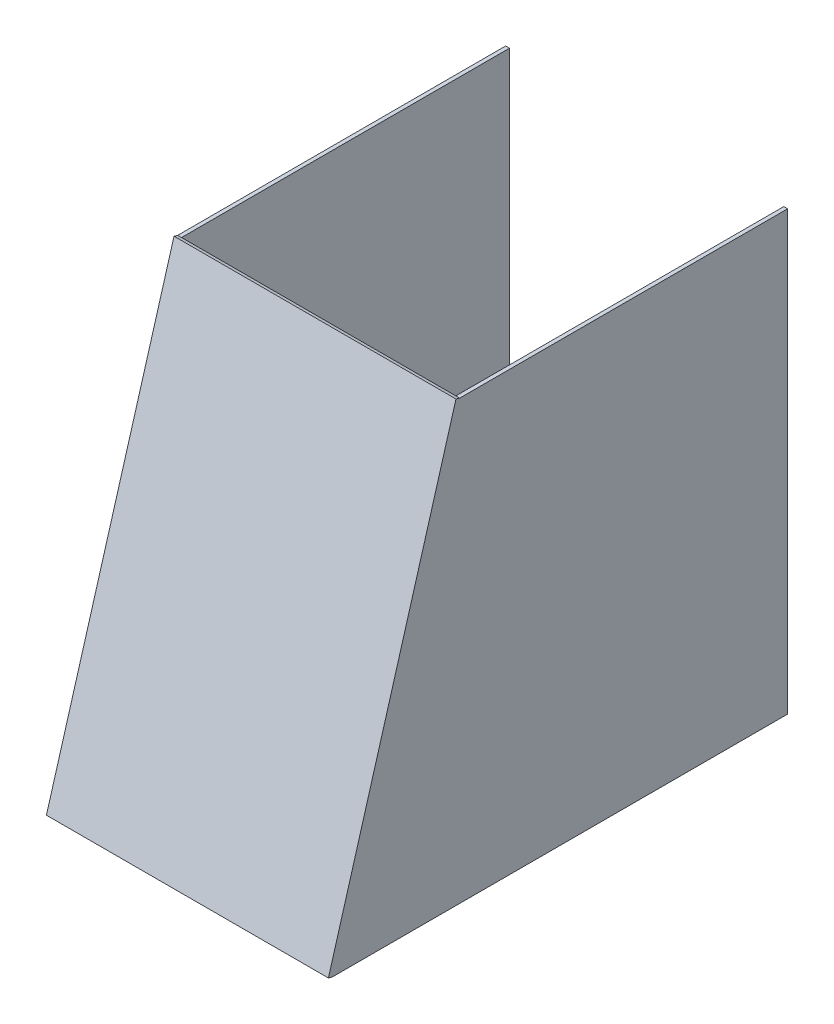
ISO-10303-21;
HEADER;
FILE_DESCRIPTION(('STEP AP214'),'2;1');
FILE_NAME('part.step','',(''),(''),'','','');
FILE_SCHEMA(('AUTOMOTIVE_DESIGN { 1 0 10303 214 1 1 1 1 }'));
ENDSEC;
DATA;
#1=APPLICATION_CONTEXT('core data for automotive mechanical design processes');
#2=APPLICATION_PROTOCOL_DEFINITION('international standard','automotive_design',2000,#1);
#3=PRODUCT_CONTEXT('',#1,'mechanical');
#4=PRODUCT('Part','Part','',(#3));
#5=PRODUCT_RELATED_PRODUCT_CATEGORY('part','',(#4));
#6=PRODUCT_DEFINITION_FORMATION('','',#4);
#7=PRODUCT_DEFINITION_CONTEXT('part definition',#1,'design');
#8=PRODUCT_DEFINITION('design','',#6,#7);
#9=PRODUCT_DEFINITION_SHAPE('','',#8);
#10=(LENGTH_UNIT() NAMED_UNIT(*) SI_UNIT(.MILLI.,.METRE.));
#11=(NAMED_UNIT(*) PLANE_ANGLE_UNIT() SI_UNIT($,.RADIAN.));
#12=(NAMED_UNIT(*) SI_UNIT($,.STERADIAN.) SOLID_ANGLE_UNIT());
#13=UNCERTAINTY_MEASURE_WITH_UNIT(LENGTH_MEASURE(1.E-05),#10,'distance_accuracy_value','');
#14=(GEOMETRIC_REPRESENTATION_CONTEXT(3) GLOBAL_UNCERTAINTY_ASSIGNED_CONTEXT((#13)) GLOBAL_UNIT_ASSIGNED_CONTEXT((#10,
#11,#12)) REPRESENTATION_CONTEXT('',''));
#15=CARTESIAN_POINT('',(0.,0.,0.));
#16=DIRECTION('',(0.,0.,1.));
#17=DIRECTION('',(1.,0.,0.));
#18=AXIS2_PLACEMENT_3D('',#15,#16,#17);
#19=CARTESIAN_POINT('',(0.,61.1869266504243,209.871158410955));
#20=DIRECTION('',(0.,-0.279892519517693,-0.960031341945688));
#21=DIRECTION('',(0.,0.960031341945688,-0.279892519517693));
#22=AXIS2_PLACEMENT_3D('',#19,#20,#21);
#23=PLANE('',#22);
#24=DIRECTION('',(1.,0.,0.));
#25=VECTOR('',#24,1.);
#26=CARTESIAN_POINT('',(110.5,-13.,231.5));
#27=LINE('',#26,#25);
#28=CARTESIAN_POINT('',(-107.5,-13.,231.5));
#29=VERTEX_POINT('',#28);
#30=CARTESIAN_POINT('',(107.5,-13.,231.5));
#31=VERTEX_POINT('',#30);
#32=EDGE_CURVE('E138',#29,#31,#27,.T.);
#33=ORIENTED_EDGE('',*,*,#32,.F.);
#34=DIRECTION('',(0.,-0.960031341945688,0.279892519517693));
#35=VECTOR('',#34,1.);
#36=CARTESIAN_POINT('',(-107.5,330.,131.5));
#37=LINE('',#36,#35);
#38=CARTESIAN_POINT('',(-107.5,330.,131.5));
#39=VERTEX_POINT('',#38);
#40=EDGE_CURVE('E146',#39,#29,#37,.T.);
#41=ORIENTED_EDGE('',*,*,#40,.F.);
#42=DIRECTION('',(-1.,0.,0.));
#43=VECTOR('',#42,1.);
#44=CARTESIAN_POINT('',(-110.5,330.,131.5));
#45=LINE('',#44,#43);
#46=CARTESIAN_POINT('',(107.5,330.,131.5));
#47=VERTEX_POINT('',#46);
#48=EDGE_CURVE('E161',#47,#39,#45,.T.);
#49=ORIENTED_EDGE('',*,*,#48,.F.);
#50=DIRECTION('',(0.,-0.960031341945688,0.279892519517693));
#51=VECTOR('',#50,1.);
#52=CARTESIAN_POINT('',(107.5,330.,131.5));
#53=LINE('',#52,#51);
#54=EDGE_CURVE('E190',#47,#31,#53,.T.);
#55=ORIENTED_EDGE('',*,*,#54,.T.);
#56=EDGE_LOOP('',(#33,#41,#49,#55));
#57=FACE_BOUND('',#56,.T.);
#58=ADVANCED_FACE('F33',(#57),#23,.T.);
#59=CARTESIAN_POINT('',(110.5,-13.,-125.5));
#60=DIRECTION('',(0.,0.,1.));
#61=DIRECTION('',(1.,0.,0.));
#62=AXIS2_PLACEMENT_3D('',#59,#60,#61);
#63=PLANE('',#62);
#64=DIRECTION('',(0.,1.,0.));
#65=VECTOR('',#64,1.);
#66=CARTESIAN_POINT('',(107.5,-13.,-125.5));
#67=LINE('',#66,#65);
#68=CARTESIAN_POINT('',(107.5,-13.,-125.5));
#69=VERTEX_POINT('',#68);
#70=CARTESIAN_POINT('',(107.5,330.,-125.5));
#71=VERTEX_POINT('',#70);
#72=EDGE_CURVE('E181',#69,#71,#67,.T.);
#73=ORIENTED_EDGE('',*,*,#72,.T.);
#74=DIRECTION('',(-1.,0.,0.));
#75=VECTOR('',#74,1.);
#76=CARTESIAN_POINT('',(110.5,330.,-125.5));
#77=LINE('',#76,#75);
#78=CARTESIAN_POINT('',(110.5,330.,-125.5));
#79=VERTEX_POINT('',#78);
#80=EDGE_CURVE('E11',#79,#71,#77,.T.);
#81=ORIENTED_EDGE('',*,*,#80,.F.);
#82=DIRECTION('',(0.,1.,0.));
#83=VECTOR('',#82,1.);
#84=CARTESIAN_POINT('',(110.5,-13.,-125.5));
#85=LINE('',#84,#83);
#86=CARTESIAN_POINT('',(110.5,-13.,-125.5));
#87=VERTEX_POINT('',#86);
#88=EDGE_CURVE('E182',#87,#79,#85,.T.);
#89=ORIENTED_EDGE('',*,*,#88,.F.);
#90=DIRECTION('',(-1.,0.,0.));
#91=VECTOR('',#90,1.);
#92=CARTESIAN_POINT('',(110.5,-13.,-125.5));
#93=LINE('',#92,#91);
#94=EDGE_CURVE('E186',#87,#69,#93,.T.);
#95=ORIENTED_EDGE('',*,*,#94,.T.);
#96=EDGE_LOOP('',(#73,#81,#89,#95));
#97=FACE_BOUND('',#96,.T.);
#98=ADVANCED_FACE('F35',(#97),#63,.F.);
#99=CARTESIAN_POINT('',(110.5,330.,-125.5));
#100=DIRECTION('',(0.,-1.,0.));
#101=DIRECTION('',(0.,0.,-1.));
#102=AXIS2_PLACEMENT_3D('',#99,#100,#101);
#103=PLANE('',#102);
#104=DIRECTION('',(0.,0.,1.));
#105=VECTOR('',#104,1.);
#106=CARTESIAN_POINT('',(107.5,330.,-125.5));
#107=LINE('',#106,#105);
#108=EDGE_CURVE('E63',#71,#47,#107,.T.);
#109=ORIENTED_EDGE('',*,*,#108,.T.);
#110=DIRECTION('',(-1.,0.,0.));
#111=VECTOR('',#110,1.);
#112=CARTESIAN_POINT('',(110.5,330.,131.5));
#113=LINE('',#112,#111);
#114=CARTESIAN_POINT('',(110.5,330.,131.5));
#115=VERTEX_POINT('',#114);
#116=EDGE_CURVE('E42',#115,#47,#113,.T.);
#117=ORIENTED_EDGE('',*,*,#116,.F.);
#118=DIRECTION('',(0.,0.,1.));
#119=VECTOR('',#118,1.);
#120=CARTESIAN_POINT('',(110.5,330.,-125.5));
#121=LINE('',#120,#119);
#122=EDGE_CURVE('E75',#79,#115,#121,.T.);
#123=ORIENTED_EDGE('',*,*,#122,.F.);
#124=ORIENTED_EDGE('',*,*,#80,.T.);
#125=EDGE_LOOP('',(#109,#117,#123,#124));
#126=FACE_BOUND('',#125,.T.);
#127=ADVANCED_FACE('F202',(#126),#103,.F.);
#128=CARTESIAN_POINT('',(110.5,-13.,231.5));
#129=DIRECTION('',(0.,1.,0.));
#130=DIRECTION('',(0.,0.,1.));
#131=AXIS2_PLACEMENT_3D('',#128,#129,#130);
#132=PLANE('',#131);
#133=DIRECTION('',(0.,0.,-1.));
#134=VECTOR('',#133,1.);
#135=CARTESIAN_POINT('',(107.5,-13.,231.5));
#136=LINE('',#135,#134);
#137=EDGE_CURVE('E70',#31,#69,#136,.T.);
#138=ORIENTED_EDGE('',*,*,#137,.T.);
#139=ORIENTED_EDGE('',*,*,#94,.F.);
#140=DIRECTION('',(0.,0.,-1.));
#141=VECTOR('',#140,1.);
#142=CARTESIAN_POINT('',(110.5,-13.,231.5));
#143=LINE('',#142,#141);
#144=CARTESIAN_POINT('',(110.5,-13.,231.5));
#145=VERTEX_POINT('',#144);
#146=EDGE_CURVE('E50',#145,#87,#143,.T.);
#147=ORIENTED_EDGE('',*,*,#146,.F.);
#148=DIRECTION('',(-1.,0.,0.));
#149=VECTOR('',#148,1.);
#150=CARTESIAN_POINT('',(110.5,-13.,231.5));
#151=LINE('',#150,#149);
#152=EDGE_CURVE('E195',#145,#31,#151,.T.);
#153=ORIENTED_EDGE('',*,*,#152,.T.);
#154=EDGE_LOOP('',(#138,#139,#147,#153));
#155=FACE_BOUND('',#154,.T.);
#156=ADVANCED_FACE('F204',(#155),#132,.F.);
#157=CARTESIAN_POINT('',(110.5,0.,0.));
#158=DIRECTION('',(1.,0.,0.));
#159=DIRECTION('',(0.,0.,-1.));
#160=AXIS2_PLACEMENT_3D('',#157,#158,#159);
#161=PLANE('',#160);
#162=ORIENTED_EDGE('',*,*,#88,.T.);
#163=ORIENTED_EDGE('',*,*,#122,.T.);
#164=DIRECTION('',(0.,-0.279892519517693,-0.960031341945688));
#165=VECTOR('',#164,1.);
#166=CARTESIAN_POINT('',(110.5,330.839677558553,134.380094025837));
#167=LINE('',#166,#165);
#168=CARTESIAN_POINT('',(110.5,330.839677558553,134.380094025837));
#169=VERTEX_POINT('',#168);
#170=EDGE_CURVE('E173',#169,#115,#167,.T.);
#171=ORIENTED_EDGE('',*,*,#170,.F.);
#172=DIRECTION('',(0.,0.960031341945688,-0.279892519517693));
#173=VECTOR('',#172,1.);
#174=CARTESIAN_POINT('',(110.5,330.839677558553,134.380094025837));
#175=LINE('',#174,#173);
#176=CARTESIAN_POINT('',(110.5,-12.1603224414469,234.380094025837));
#177=VERTEX_POINT('',#176);
#178=EDGE_CURVE('E163',#177,#169,#175,.T.);
#179=ORIENTED_EDGE('',*,*,#178,.F.);
#180=DIRECTION('',(0.,-0.279892519517693,-0.960031341945688));
#181=VECTOR('',#180,1.);
#182=CARTESIAN_POINT('',(110.5,-12.1603224414469,234.380094025837));
#183=LINE('',#182,#181);
#184=EDGE_CURVE('E176',#177,#145,#183,.T.);
#185=ORIENTED_EDGE('',*,*,#184,.T.);
#186=ORIENTED_EDGE('',*,*,#146,.T.);
#187=EDGE_LOOP('',(#162,#163,#171,#179,#185,#186));
#188=FACE_BOUND('',#187,.T.);
#189=ADVANCED_FACE('F209',(#188),#161,.T.);
#190=CARTESIAN_POINT('',(107.5,0.,0.));
#191=DIRECTION('',(1.,0.,0.));
#192=DIRECTION('',(0.,0.,-1.));
#193=AXIS2_PLACEMENT_3D('',#190,#191,#192);
#194=PLANE('',#193);
#195=ORIENTED_EDGE('',*,*,#72,.F.);
#196=ORIENTED_EDGE('',*,*,#137,.F.);
#197=ORIENTED_EDGE('',*,*,#54,.F.);
#198=ORIENTED_EDGE('',*,*,#108,.F.);
#199=EDGE_LOOP('',(#195,#196,#197,#198));
#200=FACE_BOUND('',#199,.T.);
#201=ADVANCED_FACE('F230',(#200),#194,.F.);
#202=CARTESIAN_POINT('',(-110.5,-12.1603224414469,234.380094025837));
#203=DIRECTION('',(1.,0.,0.));
#204=DIRECTION('',(0.,0.,-1.));
#205=AXIS2_PLACEMENT_3D('',#202,#203,#204);
#206=PLANE('',#205);
#207=DIRECTION('',(0.,-0.279892519517693,-0.960031341945688));
#208=VECTOR('',#207,1.);
#209=CARTESIAN_POINT('',(-110.5,330.839677558553,134.380094025837));
#210=LINE('',#209,#208);
#211=CARTESIAN_POINT('',(-110.5,330.839677558553,134.380094025837));
#212=VERTEX_POINT('',#211);
#213=CARTESIAN_POINT('',(-110.5,330.,131.5));
#214=VERTEX_POINT('',#213);
#215=EDGE_CURVE('E125',#212,#214,#210,.T.);
#216=ORIENTED_EDGE('',*,*,#215,.T.);
#217=DIRECTION('',(0.,0.,1.));
#218=VECTOR('',#217,1.);
#219=CARTESIAN_POINT('',(-110.5,330.,-125.5));
#220=LINE('',#219,#218);
#221=CARTESIAN_POINT('',(-110.5,330.,-125.5));
#222=VERTEX_POINT('',#221);
#223=EDGE_CURVE('E117',#222,#214,#220,.T.);
#224=ORIENTED_EDGE('',*,*,#223,.F.);
#225=DIRECTION('',(0.,1.,0.));
#226=VECTOR('',#225,1.);
#227=CARTESIAN_POINT('',(-110.5,-13.,-125.5));
#228=LINE('',#227,#226);
#229=CARTESIAN_POINT('',(-110.5,-13.,-125.5));
#230=VERTEX_POINT('',#229);
#231=EDGE_CURVE('E121',#230,#222,#228,.T.);
#232=ORIENTED_EDGE('',*,*,#231,.F.);
#233=DIRECTION('',(0.,0.,-1.));
#234=VECTOR('',#233,1.);
#235=CARTESIAN_POINT('',(-110.5,-13.,231.5));
#236=LINE('',#235,#234);
#237=CARTESIAN_POINT('',(-110.5,-13.,231.5));
#238=VERTEX_POINT('',#237);
#239=EDGE_CURVE('E128',#238,#230,#236,.T.);
#240=ORIENTED_EDGE('',*,*,#239,.F.);
#241=DIRECTION('',(0.,-0.279892519517693,-0.960031341945688));
#242=VECTOR('',#241,1.);
#243=CARTESIAN_POINT('',(-110.5,-12.1603224414469,234.380094025837));
#244=LINE('',#243,#242);
#245=CARTESIAN_POINT('',(-110.5,-12.1603224414469,234.380094025837));
#246=VERTEX_POINT('',#245);
#247=EDGE_CURVE('E178',#246,#238,#244,.T.);
#248=ORIENTED_EDGE('',*,*,#247,.F.);
#249=DIRECTION('',(0.,-0.960031341945688,0.279892519517693));
#250=VECTOR('',#249,1.);
#251=CARTESIAN_POINT('',(-110.5,-12.1603224414469,234.380094025837));
#252=LINE('',#251,#250);
#253=EDGE_CURVE('E157',#212,#246,#252,.T.);
#254=ORIENTED_EDGE('',*,*,#253,.F.);
#255=EDGE_LOOP('',(#216,#224,#232,#240,#248,#254));
#256=FACE_BOUND('',#255,.T.);
#257=ADVANCED_FACE('F119',(#256),#206,.F.);
#258=CARTESIAN_POINT('',(110.5,-12.1603224414469,234.380094025837));
#259=DIRECTION('',(0.,0.960031341945688,-0.279892519517693));
#260=DIRECTION('',(0.,0.279892519517693,0.960031341945688));
#261=AXIS2_PLACEMENT_3D('',#258,#259,#260);
#262=PLANE('',#261);
#263=EDGE_CURVE('E167',#238,#29,#27,.T.);
#264=ORIENTED_EDGE('',*,*,#263,.T.);
#265=ORIENTED_EDGE('',*,*,#32,.T.);
#266=ORIENTED_EDGE('',*,*,#152,.F.);
#267=ORIENTED_EDGE('',*,*,#184,.F.);
#268=DIRECTION('',(1.,0.,0.));
#269=VECTOR('',#268,1.);
#270=CARTESIAN_POINT('',(110.5,-12.1603224414469,234.380094025837));
#271=LINE('',#270,#269);
#272=EDGE_CURVE('E160',#246,#177,#271,.T.);
#273=ORIENTED_EDGE('',*,*,#272,.F.);
#274=ORIENTED_EDGE('',*,*,#247,.T.);
#275=EDGE_LOOP('',(#264,#265,#266,#267,#273,#274));
#276=FACE_BOUND('',#275,.T.);
#277=ADVANCED_FACE('F224',(#276),#262,.F.);
#278=CARTESIAN_POINT('',(-110.5,330.839677558553,134.380094025837));
#279=DIRECTION('',(0.,-0.960031341945688,0.279892519517693));
#280=DIRECTION('',(0.,-0.279892519517693,-0.960031341945688));
#281=AXIS2_PLACEMENT_3D('',#278,#279,#280);
#282=PLANE('',#281);
#283=ORIENTED_EDGE('',*,*,#116,.T.);
#284=ORIENTED_EDGE('',*,*,#48,.T.);
#285=DIRECTION('',(1.,0.,0.));
#286=VECTOR('',#285,1.);
#287=CARTESIAN_POINT('',(-110.5,330.,131.5));
#288=LINE('',#287,#286);
#289=EDGE_CURVE('E139',#214,#39,#288,.T.);
#290=ORIENTED_EDGE('',*,*,#289,.F.);
#291=ORIENTED_EDGE('',*,*,#215,.F.);
#292=DIRECTION('',(-1.,0.,0.));
#293=VECTOR('',#292,1.);
#294=CARTESIAN_POINT('',(-110.5,330.839677558553,134.380094025837));
#295=LINE('',#294,#293);
#296=EDGE_CURVE('E165',#169,#212,#295,.T.);
#297=ORIENTED_EDGE('',*,*,#296,.F.);
#298=ORIENTED_EDGE('',*,*,#170,.T.);
#299=EDGE_LOOP('',(#283,#284,#290,#291,#297,#298));
#300=FACE_BOUND('',#299,.T.);
#301=ADVANCED_FACE('F198',(#300),#282,.F.);
#302=CARTESIAN_POINT('',(0.,62.0266042089774,212.751252436792));
#303=DIRECTION('',(0.,-0.279892519517693,-0.960031341945688));
#304=DIRECTION('',(0.,0.960031341945688,-0.279892519517693));
#305=AXIS2_PLACEMENT_3D('',#302,#303,#304);
#306=PLANE('',#305);
#307=ORIENTED_EDGE('',*,*,#253,.T.);
#308=ORIENTED_EDGE('',*,*,#272,.T.);
#309=ORIENTED_EDGE('',*,*,#178,.T.);
#310=ORIENTED_EDGE('',*,*,#296,.T.);
#311=EDGE_LOOP('',(#307,#308,#309,#310));
#312=FACE_BOUND('',#311,.T.);
#313=ADVANCED_FACE('F220',(#312),#306,.F.);
#314=CARTESIAN_POINT('',(-110.5,-13.,-125.5));
#315=DIRECTION('',(0.,0.,1.));
#316=DIRECTION('',(-1.,0.,0.));
#317=AXIS2_PLACEMENT_3D('',#314,#315,#316);
#318=PLANE('',#317);
#319=DIRECTION('',(0.,1.,0.));
#320=VECTOR('',#319,1.);
#321=CARTESIAN_POINT('',(-107.5,-13.,-125.5));
#322=LINE('',#321,#320);
#323=CARTESIAN_POINT('',(-107.5,-13.,-125.5));
#324=VERTEX_POINT('',#323);
#325=CARTESIAN_POINT('',(-107.5,330.,-125.5));
#326=VERTEX_POINT('',#325);
#327=EDGE_CURVE('E150',#324,#326,#322,.T.);
#328=ORIENTED_EDGE('',*,*,#327,.F.);
#329=DIRECTION('',(1.,0.,0.));
#330=VECTOR('',#329,1.);
#331=CARTESIAN_POINT('',(-110.5,-13.,-125.5));
#332=LINE('',#331,#330);
#333=EDGE_CURVE('E143',#230,#324,#332,.T.);
#334=ORIENTED_EDGE('',*,*,#333,.F.);
#335=ORIENTED_EDGE('',*,*,#231,.T.);
#336=DIRECTION('',(1.,0.,0.));
#337=VECTOR('',#336,1.);
#338=CARTESIAN_POINT('',(-110.5,330.,-125.5));
#339=LINE('',#338,#337);
#340=EDGE_CURVE('E131',#222,#326,#339,.T.);
#341=ORIENTED_EDGE('',*,*,#340,.T.);
#342=EDGE_LOOP('',(#328,#334,#335,#341));
#343=FACE_BOUND('',#342,.T.);
#344=ADVANCED_FACE('F141',(#343),#318,.F.);
#345=CARTESIAN_POINT('',(-110.5,330.,-125.5));
#346=DIRECTION('',(0.,-1.,0.));
#347=DIRECTION('',(0.,0.,-1.));
#348=AXIS2_PLACEMENT_3D('',#345,#346,#347);
#349=PLANE('',#348);
#350=DIRECTION('',(0.,0.,1.));
#351=VECTOR('',#350,1.);
#352=CARTESIAN_POINT('',(-107.5,330.,-125.5));
#353=LINE('',#352,#351);
#354=EDGE_CURVE('E134',#326,#39,#353,.T.);
#355=ORIENTED_EDGE('',*,*,#354,.F.);
#356=ORIENTED_EDGE('',*,*,#340,.F.);
#357=ORIENTED_EDGE('',*,*,#223,.T.);
#358=ORIENTED_EDGE('',*,*,#289,.T.);
#359=EDGE_LOOP('',(#355,#356,#357,#358));
#360=FACE_BOUND('',#359,.T.);
#361=ADVANCED_FACE('F132',(#360),#349,.F.);
#362=CARTESIAN_POINT('',(-110.5,-13.,231.5));
#363=DIRECTION('',(0.,1.,0.));
#364=DIRECTION('',(0.,0.,1.));
#365=AXIS2_PLACEMENT_3D('',#362,#363,#364);
#366=PLANE('',#365);
#367=DIRECTION('',(0.,0.,-1.));
#368=VECTOR('',#367,1.);
#369=CARTESIAN_POINT('',(-107.5,-13.,231.5));
#370=LINE('',#369,#368);
#371=EDGE_CURVE('E144',#29,#324,#370,.T.);
#372=ORIENTED_EDGE('',*,*,#371,.F.);
#373=ORIENTED_EDGE('',*,*,#263,.F.);
#374=ORIENTED_EDGE('',*,*,#239,.T.);
#375=ORIENTED_EDGE('',*,*,#333,.T.);
#376=EDGE_LOOP('',(#372,#373,#374,#375));
#377=FACE_BOUND('',#376,.T.);
#378=ADVANCED_FACE('F247',(#377),#366,.F.);
#379=CARTESIAN_POINT('',(-107.5,0.,0.));
#380=DIRECTION('',(-1.,0.,0.));
#381=DIRECTION('',(0.,0.,-1.));
#382=AXIS2_PLACEMENT_3D('',#379,#380,#381);
#383=PLANE('',#382);
#384=ORIENTED_EDGE('',*,*,#327,.T.);
#385=ORIENTED_EDGE('',*,*,#354,.T.);
#386=ORIENTED_EDGE('',*,*,#40,.T.);
#387=ORIENTED_EDGE('',*,*,#371,.T.);
#388=EDGE_LOOP('',(#384,#385,#386,#387));
#389=FACE_BOUND('',#388,.T.);
#390=ADVANCED_FACE('F250',(#389),#383,.F.);
#391=CLOSED_SHELL('',(#58,#98,#127,#156,#189,#201,#257,#277,#301,#313,#344,#361,#378,#390));
#392=MANIFOLD_SOLID_BREP('B2',#391);
#393=ADVANCED_BREP_SHAPE_REPRESENTATION('',(#18,#392),#14);
#394=SHAPE_DEFINITION_REPRESENTATION(#9,#393);
ENDSEC;
END-ISO-10303-21;
